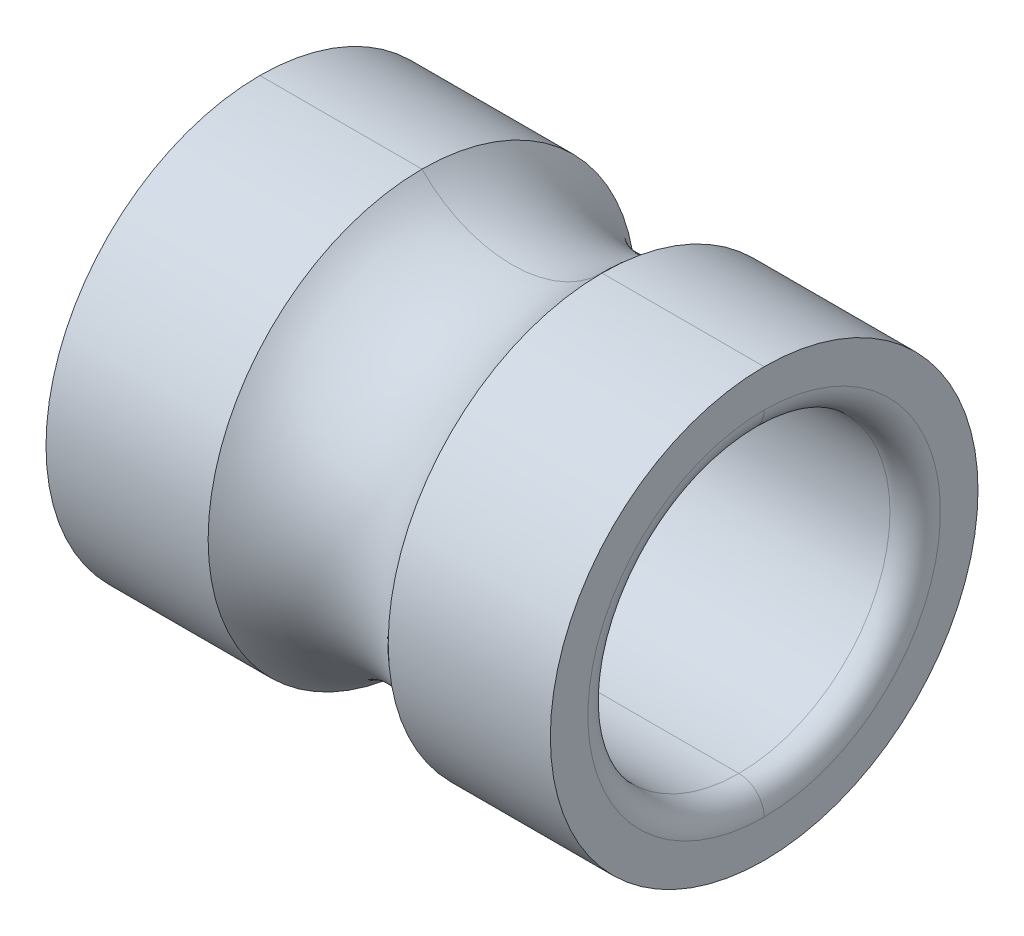
ISO-10303-21;
HEADER;
FILE_DESCRIPTION(('STEP AP214'),'2;1');
FILE_NAME('part.step','',(''),(''),'','','');
FILE_SCHEMA(('AUTOMOTIVE_DESIGN { 1 0 10303 214 1 1 1 1 }'));
ENDSEC;
DATA;
#1=APPLICATION_CONTEXT('core data for automotive mechanical design processes');
#2=APPLICATION_PROTOCOL_DEFINITION('international standard','automotive_design',2000,#1);
#3=PRODUCT_CONTEXT('',#1,'mechanical');
#4=PRODUCT('Part','Part','',(#3));
#5=PRODUCT_RELATED_PRODUCT_CATEGORY('part','',(#4));
#6=PRODUCT_DEFINITION_FORMATION('','',#4);
#7=PRODUCT_DEFINITION_CONTEXT('part definition',#1,'design');
#8=PRODUCT_DEFINITION('design','',#6,#7);
#9=PRODUCT_DEFINITION_SHAPE('','',#8);
#10=(LENGTH_UNIT() NAMED_UNIT(*) SI_UNIT(.MILLI.,.METRE.));
#11=(NAMED_UNIT(*) PLANE_ANGLE_UNIT() SI_UNIT($,.RADIAN.));
#12=(NAMED_UNIT(*) SI_UNIT($,.STERADIAN.) SOLID_ANGLE_UNIT());
#13=UNCERTAINTY_MEASURE_WITH_UNIT(LENGTH_MEASURE(1.E-05),#10,'distance_accuracy_value','');
#14=(GEOMETRIC_REPRESENTATION_CONTEXT(3) GLOBAL_UNCERTAINTY_ASSIGNED_CONTEXT((#13)) GLOBAL_UNIT_ASSIGNED_CONTEXT((#10,
#11,#12)) REPRESENTATION_CONTEXT('',''));
#15=CARTESIAN_POINT('',(0.,0.,0.));
#16=DIRECTION('',(0.,0.,1.));
#17=DIRECTION('',(1.,0.,0.));
#18=AXIS2_PLACEMENT_3D('',#15,#16,#17);
#19=CARTESIAN_POINT('',(-2.75209,0.,0.));
#20=DIRECTION('',(1.,0.,0.));
#21=DIRECTION('',(0.,-1.,0.));
#22=AXIS2_PLACEMENT_3D('',#19,#20,#21);
#23=CYLINDRICAL_SURFACE('',#22,1.4986);
#24=CARTESIAN_POINT('',(-2.25171,0.,0.));
#25=DIRECTION('',(-1.,0.,0.));
#26=DIRECTION('',(0.,1.,0.));
#27=AXIS2_PLACEMENT_3D('',#24,#25,#26);
#28=CIRCLE('',#27,1.4986);
#29=CARTESIAN_POINT('',(-2.25171,1.4986,0.));
#30=VERTEX_POINT('',#29);
#31=CARTESIAN_POINT('',(-2.25171,-1.4986,0.));
#32=VERTEX_POINT('',#31);
#33=EDGE_CURVE('E19',#30,#32,#28,.T.);
#34=ORIENTED_EDGE('',*,*,#33,.T.);
#35=DIRECTION('',(1.,0.,0.));
#36=VECTOR('',#35,1.);
#37=CARTESIAN_POINT('',(-2.25171,-1.4986,0.));
#38=LINE('',#37,#36);
#39=CARTESIAN_POINT('',(2.25171,-1.4986,0.));
#40=VERTEX_POINT('',#39);
#41=EDGE_CURVE('E11',#32,#40,#38,.T.);
#42=ORIENTED_EDGE('',*,*,#41,.T.);
#43=CARTESIAN_POINT('',(2.25171,0.,0.));
#44=DIRECTION('',(-1.,0.,0.));
#45=DIRECTION('',(0.,1.,0.));
#46=AXIS2_PLACEMENT_3D('',#43,#44,#45);
#47=CIRCLE('',#46,1.4986);
#48=CARTESIAN_POINT('',(2.25171,1.4986,0.));
#49=VERTEX_POINT('',#48);
#50=EDGE_CURVE('E84',#49,#40,#47,.T.);
#51=ORIENTED_EDGE('',*,*,#50,.F.);
#52=DIRECTION('',(1.,0.,0.));
#53=VECTOR('',#52,1.);
#54=CARTESIAN_POINT('',(-2.25171,1.4986,0.));
#55=LINE('',#54,#53);
#56=EDGE_CURVE('E24',#30,#49,#55,.T.);
#57=ORIENTED_EDGE('',*,*,#56,.F.);
#58=EDGE_LOOP('',(#34,#42,#51,#57));
#59=FACE_BOUND('',#58,.T.);
#60=ADVANCED_FACE('F16',(#59),#23,.F.);
#61=CARTESIAN_POINT('',(-2.75209,0.,0.));
#62=DIRECTION('',(1.,0.,0.));
#63=DIRECTION('',(0.,-1.,0.));
#64=AXIS2_PLACEMENT_3D('',#61,#62,#63);
#65=CYLINDRICAL_SURFACE('',#64,1.4986);
#66=CARTESIAN_POINT('',(2.25171,0.,0.));
#67=DIRECTION('',(1.,0.,0.));
#68=DIRECTION('',(0.,1.,0.));
#69=AXIS2_PLACEMENT_3D('',#66,#67,#68);
#70=CIRCLE('',#69,1.4986);
#71=EDGE_CURVE('E88',#49,#40,#70,.T.);
#72=ORIENTED_EDGE('',*,*,#71,.T.);
#73=ORIENTED_EDGE('',*,*,#41,.F.);
#74=CARTESIAN_POINT('',(-2.25171,0.,0.));
#75=DIRECTION('',(1.,0.,0.));
#76=DIRECTION('',(0.,1.,0.));
#77=AXIS2_PLACEMENT_3D('',#74,#75,#76);
#78=CIRCLE('',#77,1.4986);
#79=EDGE_CURVE('E91',#30,#32,#78,.T.);
#80=ORIENTED_EDGE('',*,*,#79,.F.);
#81=ORIENTED_EDGE('',*,*,#56,.T.);
#82=EDGE_LOOP('',(#72,#73,#80,#81));
#83=FACE_BOUND('',#82,.T.);
#84=ADVANCED_FACE('F93',(#83),#65,.F.);
#85=CARTESIAN_POINT('',(2.25171,0.,0.));
#86=DIRECTION('',(1.,0.,0.));
#87=DIRECTION('',(0.,-1.,0.));
#88=AXIS2_PLACEMENT_3D('',#85,#86,#87);
#89=TOROIDAL_SURFACE('',#88,1.74879,0.25019);
#90=CARTESIAN_POINT('',(2.5019,0.,0.));
#91=DIRECTION('',(1.,0.,0.));
#92=DIRECTION('',(0.,1.,0.));
#93=AXIS2_PLACEMENT_3D('',#90,#91,#92);
#94=CIRCLE('',#93,1.74879);
#95=CARTESIAN_POINT('',(2.5019,1.74879,0.));
#96=VERTEX_POINT('',#95);
#97=CARTESIAN_POINT('',(2.5019,-1.74879,0.));
#98=VERTEX_POINT('',#97);
#99=EDGE_CURVE('E147',#96,#98,#94,.T.);
#100=ORIENTED_EDGE('',*,*,#99,.T.);
#101=CARTESIAN_POINT('',(2.25171,-1.74879,0.));
#102=DIRECTION('',(0.,0.,-1.));
#103=DIRECTION('',(0.,1.,0.));
#104=AXIS2_PLACEMENT_3D('',#101,#102,#103);
#105=CIRCLE('',#104,0.25019);
#106=EDGE_CURVE('E151',#40,#98,#105,.T.);
#107=ORIENTED_EDGE('',*,*,#106,.F.);
#108=ORIENTED_EDGE('',*,*,#71,.F.);
#109=CARTESIAN_POINT('',(2.25171,1.74879,0.));
#110=DIRECTION('',(0.,0.,1.));
#111=DIRECTION('',(0.,-1.,0.));
#112=AXIS2_PLACEMENT_3D('',#109,#110,#111);
#113=CIRCLE('',#112,0.25019);
#114=EDGE_CURVE('E149',#49,#96,#113,.T.);
#115=ORIENTED_EDGE('',*,*,#114,.T.);
#116=EDGE_LOOP('',(#100,#107,#108,#115));
#117=FACE_BOUND('',#116,.T.);
#118=ADVANCED_FACE('F158',(#117),#89,.T.);
#119=CARTESIAN_POINT('',(2.25171,0.,0.));
#120=DIRECTION('',(1.,0.,0.));
#121=DIRECTION('',(0.,-1.,0.));
#122=AXIS2_PLACEMENT_3D('',#119,#120,#121);
#123=TOROIDAL_SURFACE('',#122,1.74879,0.25019);
#124=ORIENTED_EDGE('',*,*,#50,.T.);
#125=ORIENTED_EDGE('',*,*,#106,.T.);
#126=CARTESIAN_POINT('',(2.5019,0.,0.));
#127=DIRECTION('',(-1.,0.,0.));
#128=DIRECTION('',(0.,1.,0.));
#129=AXIS2_PLACEMENT_3D('',#126,#127,#128);
#130=CIRCLE('',#129,1.74879);
#131=EDGE_CURVE('E144',#96,#98,#130,.T.);
#132=ORIENTED_EDGE('',*,*,#131,.F.);
#133=ORIENTED_EDGE('',*,*,#114,.F.);
#134=EDGE_LOOP('',(#124,#125,#132,#133));
#135=FACE_BOUND('',#134,.T.);
#136=ADVANCED_FACE('F162',(#135),#123,.T.);
#137=CARTESIAN_POINT('',(2.5019,0.,0.));
#138=DIRECTION('',(1.,0.,0.));
#139=DIRECTION('',(0.,-1.,0.));
#140=AXIS2_PLACEMENT_3D('',#137,#138,#139);
#141=PLANE('',#140);
#142=ORIENTED_EDGE('',*,*,#99,.F.);
#143=ORIENTED_EDGE('',*,*,#131,.T.);
#144=EDGE_LOOP('',(#142,#143));
#145=FACE_BOUND('',#144,.T.);
#146=CARTESIAN_POINT('',(2.5019,0.,0.));
#147=DIRECTION('',(-1.,0.,0.));
#148=DIRECTION('',(0.,1.,0.));
#149=AXIS2_PLACEMENT_3D('',#146,#147,#148);
#150=CIRCLE('',#149,2.121535);
#151=CARTESIAN_POINT('',(2.5019,2.121535,0.));
#152=VERTEX_POINT('',#151);
#153=CARTESIAN_POINT('',(2.5019,-2.121535,0.));
#154=VERTEX_POINT('',#153);
#155=EDGE_CURVE('E139',#152,#154,#150,.T.);
#156=ORIENTED_EDGE('',*,*,#155,.F.);
#157=CARTESIAN_POINT('',(2.5019,0.,0.));
#158=DIRECTION('',(1.,0.,0.));
#159=DIRECTION('',(0.,1.,0.));
#160=AXIS2_PLACEMENT_3D('',#157,#158,#159);
#161=CIRCLE('',#160,2.121535);
#162=EDGE_CURVE('E142',#152,#154,#161,.T.);
#163=ORIENTED_EDGE('',*,*,#162,.T.);
#164=EDGE_LOOP('',(#156,#163));
#165=FACE_BOUND('',#164,.T.);
#166=ADVANCED_FACE('F164',(#145,#165),#141,.T.);
#167=CARTESIAN_POINT('',(-2.75209,0.,0.));
#168=DIRECTION('',(1.,0.,0.));
#169=DIRECTION('',(0.,-1.,0.));
#170=AXIS2_PLACEMENT_3D('',#167,#168,#169);
#171=CYLINDRICAL_SURFACE('',#170,2.121535);
#172=CARTESIAN_POINT('',(0.893356989268568,0.,0.));
#173=DIRECTION('',(1.,0.,0.));
#174=DIRECTION('',(0.,1.,0.));
#175=AXIS2_PLACEMENT_3D('',#172,#173,#174);
#176=CIRCLE('',#175,2.121535);
#177=CARTESIAN_POINT('',(0.893356989268567,2.121535,0.));
#178=VERTEX_POINT('',#177);
#179=CARTESIAN_POINT('',(0.893356989268567,-2.121535,0.));
#180=VERTEX_POINT('',#179);
#181=EDGE_CURVE('E125',#178,#180,#176,.T.);
#182=ORIENTED_EDGE('',*,*,#181,.T.);
#183=DIRECTION('',(-1.,0.,0.));
#184=VECTOR('',#183,1.);
#185=CARTESIAN_POINT('',(2.5019,-2.121535,0.));
#186=LINE('',#185,#184);
#187=EDGE_CURVE('E136',#154,#180,#186,.T.);
#188=ORIENTED_EDGE('',*,*,#187,.F.);
#189=ORIENTED_EDGE('',*,*,#162,.F.);
#190=DIRECTION('',(-1.,0.,0.));
#191=VECTOR('',#190,1.);
#192=CARTESIAN_POINT('',(2.5019,2.121535,0.));
#193=LINE('',#192,#191);
#194=EDGE_CURVE('E134',#152,#178,#193,.T.);
#195=ORIENTED_EDGE('',*,*,#194,.T.);
#196=EDGE_LOOP('',(#182,#188,#189,#195));
#197=FACE_BOUND('',#196,.T.);
#198=ADVANCED_FACE('F167',(#197),#171,.T.);
#199=CARTESIAN_POINT('',(-2.75209,0.,0.));
#200=DIRECTION('',(1.,0.,0.));
#201=DIRECTION('',(0.,-1.,0.));
#202=AXIS2_PLACEMENT_3D('',#199,#200,#201);
#203=CYLINDRICAL_SURFACE('',#202,2.121535);
#204=ORIENTED_EDGE('',*,*,#155,.T.);
#205=ORIENTED_EDGE('',*,*,#187,.T.);
#206=CARTESIAN_POINT('',(0.893356989268568,0.,0.));
#207=DIRECTION('',(-1.,0.,0.));
#208=DIRECTION('',(0.,1.,0.));
#209=AXIS2_PLACEMENT_3D('',#206,#207,#208);
#210=CIRCLE('',#209,2.121535);
#211=EDGE_CURVE('E131',#178,#180,#210,.T.);
#212=ORIENTED_EDGE('',*,*,#211,.F.);
#213=ORIENTED_EDGE('',*,*,#194,.F.);
#214=EDGE_LOOP('',(#204,#205,#212,#213));
#215=FACE_BOUND('',#214,.T.);
#216=ADVANCED_FACE('F175',(#215),#203,.T.);
#217=CARTESIAN_POINT('',(0.,0.,0.));
#218=DIRECTION('',(1.,0.,0.));
#219=DIRECTION('',(0.,-1.,0.));
#220=AXIS2_PLACEMENT_3D('',#217,#218,#219);
#221=TOROIDAL_SURFACE('',#220,2.9972,1.25095);
#222=ORIENTED_EDGE('',*,*,#211,.T.);
#223=CARTESIAN_POINT('',(0.,-2.9972,0.));
#224=DIRECTION('',(0.,0.,1.));
#225=DIRECTION('',(0.714142842854284,0.700000000000001,0.));
#226=AXIS2_PLACEMENT_3D('',#223,#224,#225);
#227=CIRCLE('',#226,1.25095);
#228=CARTESIAN_POINT('',(-0.893356989268568,-2.121535,0.));
#229=VERTEX_POINT('',#228);
#230=EDGE_CURVE('E127',#180,#229,#227,.T.);
#231=ORIENTED_EDGE('',*,*,#230,.T.);
#232=CARTESIAN_POINT('',(-0.893356989268567,0.,0.));
#233=DIRECTION('',(-1.,0.,0.));
#234=DIRECTION('',(0.,1.,0.));
#235=AXIS2_PLACEMENT_3D('',#232,#233,#234);
#236=CIRCLE('',#235,2.121535);
#237=CARTESIAN_POINT('',(-0.893356989268568,2.121535,0.));
#238=VERTEX_POINT('',#237);
#239=EDGE_CURVE('E118',#238,#229,#236,.T.);
#240=ORIENTED_EDGE('',*,*,#239,.F.);
#241=CARTESIAN_POINT('',(0.,2.9972,0.));
#242=DIRECTION('',(0.,0.,-1.));
#243=DIRECTION('',(0.714142842854284,-0.700000000000001,0.));
#244=AXIS2_PLACEMENT_3D('',#241,#242,#243);
#245=CIRCLE('',#244,1.25095);
#246=EDGE_CURVE('E124',#178,#238,#245,.T.);
#247=ORIENTED_EDGE('',*,*,#246,.F.);
#248=EDGE_LOOP('',(#222,#231,#240,#247));
#249=FACE_BOUND('',#248,.T.);
#250=ADVANCED_FACE('F180',(#249),#221,.F.);
#251=CARTESIAN_POINT('',(0.,0.,0.));
#252=DIRECTION('',(1.,0.,0.));
#253=DIRECTION('',(0.,-1.,0.));
#254=AXIS2_PLACEMENT_3D('',#251,#252,#253);
#255=TOROIDAL_SURFACE('',#254,2.9972,1.25095);
#256=CARTESIAN_POINT('',(-0.893356989268567,0.,0.));
#257=DIRECTION('',(1.,0.,0.));
#258=DIRECTION('',(0.,1.,0.));
#259=AXIS2_PLACEMENT_3D('',#256,#257,#258);
#260=CIRCLE('',#259,2.121535);
#261=EDGE_CURVE('E121',#238,#229,#260,.T.);
#262=ORIENTED_EDGE('',*,*,#261,.T.);
#263=ORIENTED_EDGE('',*,*,#230,.F.);
#264=ORIENTED_EDGE('',*,*,#181,.F.);
#265=ORIENTED_EDGE('',*,*,#246,.T.);
#266=EDGE_LOOP('',(#262,#263,#264,#265));
#267=FACE_BOUND('',#266,.T.);
#268=ADVANCED_FACE('F183',(#267),#255,.F.);
#269=CARTESIAN_POINT('',(-2.75209,0.,0.));
#270=DIRECTION('',(1.,0.,0.));
#271=DIRECTION('',(0.,-1.,0.));
#272=AXIS2_PLACEMENT_3D('',#269,#270,#271);
#273=CYLINDRICAL_SURFACE('',#272,2.121535);
#274=CARTESIAN_POINT('',(-2.5019,0.,0.));
#275=DIRECTION('',(1.,0.,0.));
#276=DIRECTION('',(0.,1.,0.));
#277=AXIS2_PLACEMENT_3D('',#274,#275,#276);
#278=CIRCLE('',#277,2.121535);
#279=CARTESIAN_POINT('',(-2.5019,2.121535,0.));
#280=VERTEX_POINT('',#279);
#281=CARTESIAN_POINT('',(-2.5019,-2.121535,0.));
#282=VERTEX_POINT('',#281);
#283=EDGE_CURVE('E38',#280,#282,#278,.T.);
#284=ORIENTED_EDGE('',*,*,#283,.T.);
#285=DIRECTION('',(-1.,0.,0.));
#286=VECTOR('',#285,1.);
#287=CARTESIAN_POINT('',(-0.893356989268568,-2.121535,0.));
#288=LINE('',#287,#286);
#289=EDGE_CURVE('E116',#229,#282,#288,.T.);
#290=ORIENTED_EDGE('',*,*,#289,.F.);
#291=ORIENTED_EDGE('',*,*,#261,.F.);
#292=DIRECTION('',(-1.,0.,0.));
#293=VECTOR('',#292,1.);
#294=CARTESIAN_POINT('',(-0.893356989268568,2.121535,0.));
#295=LINE('',#294,#293);
#296=EDGE_CURVE('E114',#238,#280,#295,.T.);
#297=ORIENTED_EDGE('',*,*,#296,.T.);
#298=EDGE_LOOP('',(#284,#290,#291,#297));
#299=FACE_BOUND('',#298,.T.);
#300=ADVANCED_FACE('F185',(#299),#273,.T.);
#301=CARTESIAN_POINT('',(-2.75209,0.,0.));
#302=DIRECTION('',(1.,0.,0.));
#303=DIRECTION('',(0.,-1.,0.));
#304=AXIS2_PLACEMENT_3D('',#301,#302,#303);
#305=CYLINDRICAL_SURFACE('',#304,2.121535);
#306=ORIENTED_EDGE('',*,*,#239,.T.);
#307=ORIENTED_EDGE('',*,*,#289,.T.);
#308=CARTESIAN_POINT('',(-2.5019,0.,0.));
#309=DIRECTION('',(-1.,0.,0.));
#310=DIRECTION('',(0.,1.,0.));
#311=AXIS2_PLACEMENT_3D('',#308,#309,#310);
#312=CIRCLE('',#311,2.121535);
#313=EDGE_CURVE('E96',#280,#282,#312,.T.);
#314=ORIENTED_EDGE('',*,*,#313,.F.);
#315=ORIENTED_EDGE('',*,*,#296,.F.);
#316=EDGE_LOOP('',(#306,#307,#314,#315));
#317=FACE_BOUND('',#316,.T.);
#318=ADVANCED_FACE('F188',(#317),#305,.T.);
#319=CARTESIAN_POINT('',(-2.5019,0.,0.));
#320=DIRECTION('',(1.,0.,0.));
#321=DIRECTION('',(0.,-1.,0.));
#322=AXIS2_PLACEMENT_3D('',#319,#320,#321);
#323=PLANE('',#322);
#324=CARTESIAN_POINT('',(-2.5019,0.,0.));
#325=DIRECTION('',(-1.,0.,0.));
#326=DIRECTION('',(0.,1.,0.));
#327=AXIS2_PLACEMENT_3D('',#324,#325,#326);
#328=CIRCLE('',#327,1.74879);
#329=CARTESIAN_POINT('',(-2.5019,1.74879,0.));
#330=VERTEX_POINT('',#329);
#331=CARTESIAN_POINT('',(-2.5019,-1.74879,0.));
#332=VERTEX_POINT('',#331);
#333=EDGE_CURVE('E106',#330,#332,#328,.T.);
#334=ORIENTED_EDGE('',*,*,#333,.F.);
#335=CARTESIAN_POINT('',(-2.5019,0.,0.));
#336=DIRECTION('',(1.,0.,0.));
#337=DIRECTION('',(0.,1.,0.));
#338=AXIS2_PLACEMENT_3D('',#335,#336,#337);
#339=CIRCLE('',#338,1.74879);
#340=EDGE_CURVE('E30',#330,#332,#339,.T.);
#341=ORIENTED_EDGE('',*,*,#340,.T.);
#342=EDGE_LOOP('',(#334,#341));
#343=FACE_BOUND('',#342,.T.);
#344=ORIENTED_EDGE('',*,*,#283,.F.);
#345=ORIENTED_EDGE('',*,*,#313,.T.);
#346=EDGE_LOOP('',(#344,#345));
#347=FACE_BOUND('',#346,.T.);
#348=ADVANCED_FACE('F190',(#343,#347),#323,.F.);
#349=CARTESIAN_POINT('',(-2.25171,0.,0.));
#350=DIRECTION('',(1.,0.,0.));
#351=DIRECTION('',(0.,-1.,0.));
#352=AXIS2_PLACEMENT_3D('',#349,#350,#351);
#353=TOROIDAL_SURFACE('',#352,1.74879,0.25019);
#354=ORIENTED_EDGE('',*,*,#79,.T.);
#355=CARTESIAN_POINT('',(-2.25171,-1.74879,0.));
#356=DIRECTION('',(0.,0.,-1.));
#357=DIRECTION('',(-1.,0.,0.));
#358=AXIS2_PLACEMENT_3D('',#355,#356,#357);
#359=CIRCLE('',#358,0.25019);
#360=EDGE_CURVE('E105',#332,#32,#359,.T.);
#361=ORIENTED_EDGE('',*,*,#360,.F.);
#362=ORIENTED_EDGE('',*,*,#340,.F.);
#363=CARTESIAN_POINT('',(-2.25171,1.74879,0.));
#364=DIRECTION('',(0.,0.,1.));
#365=DIRECTION('',(-1.,0.,0.));
#366=AXIS2_PLACEMENT_3D('',#363,#364,#365);
#367=CIRCLE('',#366,0.25019);
#368=EDGE_CURVE('E99',#330,#30,#367,.T.);
#369=ORIENTED_EDGE('',*,*,#368,.T.);
#370=EDGE_LOOP('',(#354,#361,#362,#369));
#371=FACE_BOUND('',#370,.T.);
#372=ADVANCED_FACE('F100',(#371),#353,.T.);
#373=CARTESIAN_POINT('',(-2.25171,0.,0.));
#374=DIRECTION('',(1.,0.,0.));
#375=DIRECTION('',(0.,-1.,0.));
#376=AXIS2_PLACEMENT_3D('',#373,#374,#375);
#377=TOROIDAL_SURFACE('',#376,1.74879,0.25019);
#378=ORIENTED_EDGE('',*,*,#333,.T.);
#379=ORIENTED_EDGE('',*,*,#360,.T.);
#380=ORIENTED_EDGE('',*,*,#33,.F.);
#381=ORIENTED_EDGE('',*,*,#368,.F.);
#382=EDGE_LOOP('',(#378,#379,#380,#381));
#383=FACE_BOUND('',#382,.T.);
#384=ADVANCED_FACE('F104',(#383),#377,.T.);
#385=CLOSED_SHELL('',(#60,#84,#118,#136,#166,#198,#216,#250,#268,#300,#318,#348,#372,#384));
#386=MANIFOLD_SOLID_BREP('B1',#385);
#387=ADVANCED_BREP_SHAPE_REPRESENTATION('',(#18,#386),#14);
#388=SHAPE_DEFINITION_REPRESENTATION(#9,#387);
ENDSEC;
END-ISO-10303-21;
